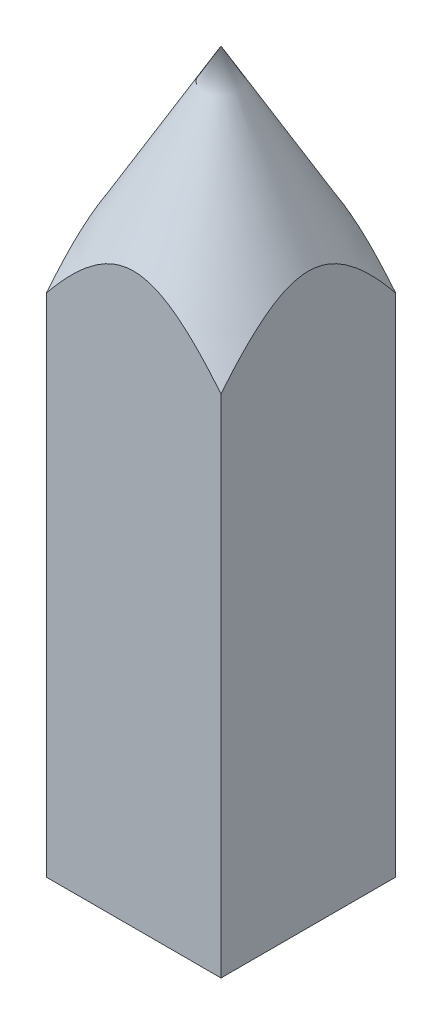
ISO-10303-21;
HEADER;
FILE_DESCRIPTION(('STEP AP214'),'2;1');
FILE_NAME('part.step','',(''),(''),'','','');
FILE_SCHEMA(('AUTOMOTIVE_DESIGN { 1 0 10303 214 1 1 1 1 }'));
ENDSEC;
DATA;
#1=APPLICATION_CONTEXT('core data for automotive mechanical design processes');
#2=APPLICATION_PROTOCOL_DEFINITION('international standard','automotive_design',2000,#1);
#3=PRODUCT_CONTEXT('',#1,'mechanical');
#4=PRODUCT('Part','Part','',(#3));
#5=PRODUCT_RELATED_PRODUCT_CATEGORY('part','',(#4));
#6=PRODUCT_DEFINITION_FORMATION('','',#4);
#7=PRODUCT_DEFINITION_CONTEXT('part definition',#1,'design');
#8=PRODUCT_DEFINITION('design','',#6,#7);
#9=PRODUCT_DEFINITION_SHAPE('','',#8);
#10=(LENGTH_UNIT() NAMED_UNIT(*) SI_UNIT(.MILLI.,.METRE.));
#11=(NAMED_UNIT(*) PLANE_ANGLE_UNIT() SI_UNIT($,.RADIAN.));
#12=(NAMED_UNIT(*) SI_UNIT($,.STERADIAN.) SOLID_ANGLE_UNIT());
#13=UNCERTAINTY_MEASURE_WITH_UNIT(LENGTH_MEASURE(1.E-05),#10,'distance_accuracy_value','');
#14=(GEOMETRIC_REPRESENTATION_CONTEXT(3) GLOBAL_UNCERTAINTY_ASSIGNED_CONTEXT((#13)) GLOBAL_UNIT_ASSIGNED_CONTEXT((#10,
#11,#12)) REPRESENTATION_CONTEXT('',''));
#15=CARTESIAN_POINT('',(0.,0.,0.));
#16=DIRECTION('',(0.,0.,1.));
#17=DIRECTION('',(1.,0.,0.));
#18=AXIS2_PLACEMENT_3D('',#15,#16,#17);
#19=CARTESIAN_POINT('',(0.,28.9578141860761,0.));
#20=DIRECTION('',(0.,-1.,0.));
#21=DIRECTION('',(0.,0.,-1.));
#22=AXIS2_PLACEMENT_3D('',#19,#20,#21);
#23=CONICAL_SURFACE('',#22,7.07106781187,0.523598775598293);
#24=CARTESIAN_POINT('',(-5.0000000000032,23.7736541344682,-8.73424265280935));
#25=CARTESIAN_POINT('',(-5.0000000000032,24.0540652325333,-8.54766544211133));
#26=CARTESIAN_POINT('',(-5.0000000000032,24.3338278924239,-8.36010390508928));
#27=CARTESIAN_POINT('',(-5.0000000000032,24.8917250174469,-7.98250325130816));
#28=CARTESIAN_POINT('',(-5.0000000000032,25.1698592791151,-7.79246383412938));
#29=CARTESIAN_POINT('',(-5.0000000000032,25.7255058395061,-7.40847202366486));
#30=CARTESIAN_POINT('',(-5.0000000000032,26.0030078184527,-7.21450466672878));
#31=CARTESIAN_POINT('',(-5.0000000000032,26.5554072903616,-6.82292758607558));
#32=CARTESIAN_POINT('',(-5.0000000000032,26.8303049497034,-6.6253180974477));
#33=CARTESIAN_POINT('',(-5.0000000000032,27.393866426577,-6.2130458318071));
#34=CARTESIAN_POINT('',(-5.0000000000032,27.6823162265441,-5.99808935307074));
#35=CARTESIAN_POINT('',(-5.0000000000032,28.2541432919948,-5.56155576253747));
#36=CARTESIAN_POINT('',(-5.0000000000032,28.5375209280372,-5.33997913757409));
#37=CARTESIAN_POINT('',(-5.0000000000032,29.096666934399,-4.8885254808277));
#38=CARTESIAN_POINT('',(-5.0000000000032,29.3724502104133,-4.65866711052706));
#39=CARTESIAN_POINT('',(-5.0000000000032,29.7782963827993,-4.30498586101745));
#40=CARTESIAN_POINT('',(-5.0000000000032,29.9122520422274,-4.18563039902351));
#41=CARTESIAN_POINT('',(-5.0000000000032,30.1769225249654,-3.94338595905392));
#42=CARTESIAN_POINT('',(-5.0000000000032,30.3076376793685,-3.82049734486626));
#43=CARTESIAN_POINT('',(-5.0000000000032,30.5059216775693,-3.62788939671447));
#44=CARTESIAN_POINT('',(-5.0000000000032,30.5749350084248,-3.55965615240548));
#45=CARTESIAN_POINT('',(-5.0000000000032,30.7115895042223,-3.42182961094149));
#46=CARTESIAN_POINT('',(-5.0000000000032,30.779230660085,-3.35223630479346));
#47=CARTESIAN_POINT('',(-5.0000000000032,30.9798645420278,-3.14114734004477));
#48=CARTESIAN_POINT('',(-5.0000000000032,31.1105127509677,-2.99739549056884));
#49=CARTESIAN_POINT('',(-5.0000000000032,31.3625228606067,-2.70358444641824));
#50=CARTESIAN_POINT('',(-5.0000000000032,31.4839412938822,-2.55357415983834));
#51=CARTESIAN_POINT('',(-5.0000000000032,31.7151989300796,-2.24494421601222));
#52=CARTESIAN_POINT('',(-5.0000000000032,31.8250476156706,-2.08633177328417));
#53=CARTESIAN_POINT('',(-5.0000000000032,32.0319696440477,-1.7534931046854));
#54=CARTESIAN_POINT('',(-5.0000000000032,32.1285022799582,-1.57892448270719));
#55=CARTESIAN_POINT('',(-5.0000000000032,32.296771371754,-1.21805588659845));
#56=CARTESIAN_POINT('',(-5.0000000000032,32.3685524384725,-1.03177774138263));
#57=CARTESIAN_POINT('',(-5.0000000000032,32.4467879010389,-0.759443677962475));
#58=CARTESIAN_POINT('',(-5.0000000000032,32.4670812654125,-0.67729020924667));
#59=CARTESIAN_POINT('',(-5.0000000000032,32.5009515568315,-0.511625448329228));
#60=CARTESIAN_POINT('',(-5.0000000000032,32.5145315969921,-0.428114804071417));
#61=CARTESIAN_POINT('',(-5.0000000000032,32.5344995815338,-0.260239655929377));
#62=CARTESIAN_POINT('',(-5.0000000000032,32.5408881545041,-0.17587522732292));
#63=CARTESIAN_POINT('',(-5.0000000000032,32.5462364497911,-0.00690787450946477));
#64=CARTESIAN_POINT('',(-5.0000000000032,32.5451960849406,0.0776950524843081));
#65=CARTESIAN_POINT('',(-5.0000000000032,32.5357256906657,0.246432319192591));
#66=CARTESIAN_POINT('',(-5.0000000000032,32.527300265129,0.330566917986507));
#67=CARTESIAN_POINT('',(-5.0000000000032,32.5033876288211,0.497838313341772));
#68=CARTESIAN_POINT('',(-5.0000000000032,32.4878974962884,0.58097468244919));
#69=CARTESIAN_POINT('',(-5.0000000000032,32.4315856748397,0.828080127763474));
#70=CARTESIAN_POINT('',(-5.0000000000032,32.3809146799774,0.9898650598785));
#71=CARTESIAN_POINT('',(-5.0000000000032,32.270488020645,1.27500229542668));
#72=CARTESIAN_POINT('',(-5.0000000000032,32.2143015070797,1.3998050783153));
#73=CARTESIAN_POINT('',(-5.0000000000032,32.091118430921,1.64403341019271));
#74=CARTESIAN_POINT('',(-5.0000000000032,32.0241141158637,1.76345502372688));
#75=CARTESIAN_POINT('',(-5.0000000000032,31.8813439780076,1.99764109197237));
#76=CARTESIAN_POINT('',(-5.0000000000032,31.8055385058628,2.11238105527226));
#77=CARTESIAN_POINT('',(-5.0000000000032,31.647309775319,2.33709595239964));
#78=CARTESIAN_POINT('',(-5.0000000000032,31.5648892110443,2.44707279828406));
#79=CARTESIAN_POINT('',(-5.0000000000032,31.3905455173909,2.66828443026842));
#80=CARTESIAN_POINT('',(-5.0000000000032,31.2983531207694,2.77930568270386));
#81=CARTESIAN_POINT('',(-5.0000000000032,31.109395120986,2.99740358957158));
#82=CARTESIAN_POINT('',(-5.0000000000032,31.0126285519854,3.10447940235218));
#83=CARTESIAN_POINT('',(-5.0000000000032,30.8153603451829,3.31530318432316));
#84=CARTESIAN_POINT('',(-5.0000000000032,30.7148553744544,3.41904802250085));
#85=CARTESIAN_POINT('',(-5.0000000000032,30.5108707476953,3.62357784634008));
#86=CARTESIAN_POINT('',(-5.0000000000032,30.4073908164446,3.72436255639884));
#87=CARTESIAN_POINT('',(-5.0000000000032,30.0925703966218,4.02358697141119));
#88=CARTESIAN_POINT('',(-5.0000000000032,29.8775534272445,4.2181589865785));
#89=CARTESIAN_POINT('',(-5.0000000000032,29.4408474959083,4.59936582831352));
#90=CARTESIAN_POINT('',(-5.0000000000032,29.2191617253118,4.786004351435));
#91=CARTESIAN_POINT('',(-5.0000000000032,28.7673899292071,5.15600289491754));
#92=CARTESIAN_POINT('',(-5.0000000000032,28.5372272690637,5.33926903528306));
#93=CARTESIAN_POINT('',(-5.0000000000032,28.073033106822,5.70086526331649));
#94=CARTESIAN_POINT('',(-5.0000000000032,27.8390011951877,5.8791948230663));
#95=CARTESIAN_POINT('',(-5.0000000000032,27.3685231679728,6.23145183617741));
#96=CARTESIAN_POINT('',(-5.0000000000032,27.1320841226582,6.40538875522379));
#97=CARTESIAN_POINT('',(-5.0000000000032,26.6568749521142,6.75001674844249));
#98=CARTESIAN_POINT('',(-5.0000000000032,26.4181049430233,6.92070798309216));
#99=CARTESIAN_POINT('',(-5.0000000000032,25.9119593971503,7.27828871242433));
#100=CARTESIAN_POINT('',(-5.0000000000032,25.6443616294906,7.46486326913252));
#101=CARTESIAN_POINT('',(-5.0000000000032,25.1072890686513,7.83529329559788));
#102=CARTESIAN_POINT('',(-5.0000000000032,24.8378142516572,8.01914873076414));
#103=CARTESIAN_POINT('',(-5.0000000000032,24.0270826230258,8.56736118954026));
#104=CARTESIAN_POINT('',(-5.0000000000032,23.4835455785291,8.92834548576798));
#105=CARTESIAN_POINT('',(-5.0000000000032,22.3921682508917,9.64396800791292));
#106=CARTESIAN_POINT('',(-5.0000000000032,21.8443271066892,9.99860491494592));
#107=CARTESIAN_POINT('',(-5.0000000000032,20.7455770467977,10.7031012010906));
#108=CARTESIAN_POINT('',(-5.0000000000032,20.1946680986819,11.0529605295676));
#109=CARTESIAN_POINT('',(-5.0000000000032,19.0895730568646,11.7496447825337));
#110=CARTESIAN_POINT('',(-5.0000000000032,18.5353828849934,12.0964632285595));
#111=CARTESIAN_POINT('',(-5.0000000000032,17.4252174345547,12.7872367719154));
#112=CARTESIAN_POINT('',(-5.0000000000032,16.8692421445285,13.1311918508144));
#113=CARTESIAN_POINT('',(-5.0000000000032,15.7559572032741,13.8167748625702));
#114=CARTESIAN_POINT('',(-5.0000000000032,15.198647731004,14.1584030862264));
#115=CARTESIAN_POINT('',(-5.0000000000032,14.0828975479053,14.8398070379077));
#116=CARTESIAN_POINT('',(-5.0000000000032,13.5244568362963,15.1795827646542));
#117=CARTESIAN_POINT('',(-5.0000000000032,11.9656521302576,16.1251264253137));
#118=CARTESIAN_POINT('',(-5.0000000000032,10.96427786038,16.7292286185559));
#119=CARTESIAN_POINT('',(-5.0000000000032,8.95938674977834,17.9339498346395));
#120=CARTESIAN_POINT('',(-5.0000000000032,7.95586982873238,18.5345687236502));
#121=CARTESIAN_POINT('',(-5.0000000000032,5.94974069610893,19.7317063138774));
#122=CARTESIAN_POINT('',(-5.0000000000032,4.94713233274883,20.3282314671117));
#123=CARTESIAN_POINT('',(-5.0000000000032,2.94074522768082,21.5192101152898));
#124=CARTESIAN_POINT('',(-5.0000000000032,1.93696653932907,22.1136637001009));
#125=CARTESIAN_POINT('',(-5.0000000000032,0.932752627348328,22.7073782697805));
#126=B_SPLINE_CURVE_WITH_KNOTS('',3,(#24,#25,#26,#27,#28,#29,#30,#31,#32,#33,#34,#35,#36,#37,
#38,#39,#40,#41,#42,#43,#44,#45,#46,#47,#48,#49,#50,#51,#52,#53,#54,#55,#56,#57,#58,#59,#60,#61,
#62,#63,#64,#65,#66,#67,#68,#69,#70,#71,#72,#73,#74,#75,#76,#77,#78,#79,#80,#81,#82,#83,#84,#85,
#86,#87,#88,#89,#90,#91,#92,#93,#94,#95,#96,#97,#98,#99,#100,#101,#102,#103,#104,#105,#106,#107,
#108,#109,#110,#111,#112,#113,#114,#115,#116,#117,#118,#119,#120,#121,#122,#123,#124,#125),
.UNSPECIFIED.,.F.,.F.,(4,2,2,2,2,2,2,2,2,2,2,2,2,2,2,2,2,2,2,2,2,2,2,2,2,2,2,2,2,2,2,2,2,2,2,2,
2,2,2,2,2,2,2,2,2,2,2,2,2,2,4),(0.,1.01043803253413,2.02099973186052,3.03668997097113,
4.052314878182,5.13144510306951,6.21049616505982,7.28725160962294,7.82545051008001,
8.36359419241303,8.65472547500499,8.94585868327326,9.52835361518778,10.1069319804137,
10.6850323857187,11.2821955337718,11.8782766929208,12.1319146181267,12.3854348152905,
12.6389328511338,12.8924338613992,13.1457769500412,13.3992249093062,13.9057658078872,
14.3158167625183,14.7261628909995,15.1384351427028,15.5505403323544,15.9833136567052,
16.4161787731449,16.8494395176064,17.282740473759,18.1523986743461,19.021647119891,
19.9041978407703,20.7868425798832,21.6673869221442,22.5478876135813,23.526522554569,
24.5051699344248,26.4625633841046,28.420358934164,30.3781752176323,32.3394621012104,
34.3007615995534,36.2618113126743,38.2228623790785,41.7312993496416,45.2398702352303,
48.7398092363002,52.2395944667742),.UNSPECIFIED.);
#127=CARTESIAN_POINT('',(-5.0000000000032,28.9578141860761,5.0000000000032));
#128=VERTEX_POINT('',#127);
#129=CARTESIAN_POINT('',(-5.0000000000032,28.9578141860761,-5.0000000000032));
#130=VERTEX_POINT('',#129);
#131=EDGE_CURVE('E12',#128,#130,#126,.F.);
#132=ORIENTED_EDGE('',*,*,#131,.F.);
#133=CARTESIAN_POINT('',(-8.73424265280935,23.7736541344682,5.0000000000032));
#134=CARTESIAN_POINT('',(-8.54766544211133,24.0540652325333,5.0000000000032));
#135=CARTESIAN_POINT('',(-8.36010390508928,24.3338278924239,5.0000000000032));
#136=CARTESIAN_POINT('',(-7.98250325130817,24.8917250174469,5.0000000000032));
#137=CARTESIAN_POINT('',(-7.79246383412939,25.1698592791151,5.0000000000032));
#138=CARTESIAN_POINT('',(-7.40847202366486,25.7255058395061,5.0000000000032));
#139=CARTESIAN_POINT('',(-7.21450466672879,26.0030078184527,5.0000000000032));
#140=CARTESIAN_POINT('',(-6.82292758607559,26.5554072903616,5.0000000000032));
#141=CARTESIAN_POINT('',(-6.62531809744771,26.8303049497034,5.0000000000032));
#142=CARTESIAN_POINT('',(-6.2130458318071,27.3938664265769,5.0000000000032));
#143=CARTESIAN_POINT('',(-5.99808935307075,27.6823162265441,5.0000000000032));
#144=CARTESIAN_POINT('',(-5.56155576253747,28.2541432919947,5.0000000000032));
#145=CARTESIAN_POINT('',(-5.33997913757409,28.5375209280372,5.0000000000032));
#146=CARTESIAN_POINT('',(-4.8885254808277,29.096666934399,5.0000000000032));
#147=CARTESIAN_POINT('',(-4.65866711052706,29.3724502104133,5.0000000000032));
#148=CARTESIAN_POINT('',(-4.30498586101745,29.7782963827993,5.0000000000032));
#149=CARTESIAN_POINT('',(-4.18563039902352,29.9122520422274,5.0000000000032));
#150=CARTESIAN_POINT('',(-3.94338595905392,30.1769225249654,5.0000000000032));
#151=CARTESIAN_POINT('',(-3.82049734486626,30.3076376793685,5.0000000000032));
#152=CARTESIAN_POINT('',(-3.62788939671446,30.5059216775693,5.0000000000032));
#153=CARTESIAN_POINT('',(-3.55965615240548,30.5749350084248,5.0000000000032));
#154=CARTESIAN_POINT('',(-3.42182961094149,30.7115895042223,5.0000000000032));
#155=CARTESIAN_POINT('',(-3.35223630479346,30.779230660085,5.0000000000032));
#156=CARTESIAN_POINT('',(-3.14114734004476,30.9798645420278,5.0000000000032));
#157=CARTESIAN_POINT('',(-2.99739549056884,31.1105127509677,5.0000000000032));
#158=CARTESIAN_POINT('',(-2.70358444641824,31.3625228606067,5.0000000000032));
#159=CARTESIAN_POINT('',(-2.55357415983834,31.4839412938822,5.0000000000032));
#160=CARTESIAN_POINT('',(-2.24494421601222,31.7151989300795,5.0000000000032));
#161=CARTESIAN_POINT('',(-2.08633177328418,31.8250476156706,5.0000000000032));
#162=CARTESIAN_POINT('',(-1.75349310468541,32.0319696440477,5.0000000000032));
#163=CARTESIAN_POINT('',(-1.5789244827072,32.1285022799582,5.0000000000032));
#164=CARTESIAN_POINT('',(-1.21805588659846,32.296771371754,5.0000000000032));
#165=CARTESIAN_POINT('',(-1.03177774138264,32.3685524384725,5.0000000000032));
#166=CARTESIAN_POINT('',(-0.759443677962486,32.4467879010389,5.0000000000032));
#167=CARTESIAN_POINT('',(-0.67729020924668,32.4670812654125,5.0000000000032));
#168=CARTESIAN_POINT('',(-0.511625448329238,32.5009515568315,5.0000000000032));
#169=CARTESIAN_POINT('',(-0.428114804071427,32.5145315969921,5.0000000000032));
#170=CARTESIAN_POINT('',(-0.260239655929387,32.5344995815338,5.0000000000032));
#171=CARTESIAN_POINT('',(-0.175875227322929,32.5408881545041,5.0000000000032));
#172=CARTESIAN_POINT('',(-0.00690787450947375,32.5462364497911,5.0000000000032));
#173=CARTESIAN_POINT('',(0.0776950524842993,32.5451960849406,5.0000000000032));
#174=CARTESIAN_POINT('',(0.246432319192582,32.5357256906657,5.0000000000032));
#175=CARTESIAN_POINT('',(0.330566917986498,32.527300265129,5.0000000000032));
#176=CARTESIAN_POINT('',(0.497838313341764,32.5033876288211,5.0000000000032));
#177=CARTESIAN_POINT('',(0.580974682449183,32.4878974962884,5.0000000000032));
#178=CARTESIAN_POINT('',(0.828080127763468,32.4315856748397,5.0000000000032));
#179=CARTESIAN_POINT('',(0.989865059878495,32.3809146799774,5.0000000000032));
#180=CARTESIAN_POINT('',(1.27500229542668,32.270488020645,5.0000000000032));
#181=CARTESIAN_POINT('',(1.3998050783153,32.2143015070797,5.0000000000032));
#182=CARTESIAN_POINT('',(1.64403341019271,32.091118430921,5.0000000000032));
#183=CARTESIAN_POINT('',(1.76345502372688,32.0241141158636,5.0000000000032));
#184=CARTESIAN_POINT('',(1.99764109197237,31.8813439780076,5.0000000000032));
#185=CARTESIAN_POINT('',(2.11238105527225,31.8055385058629,5.0000000000032));
#186=CARTESIAN_POINT('',(2.33709595239964,31.647309775319,5.0000000000032));
#187=CARTESIAN_POINT('',(2.44707279828405,31.5648892110443,5.0000000000032));
#188=CARTESIAN_POINT('',(2.66828443026841,31.3905455173909,5.0000000000032));
#189=CARTESIAN_POINT('',(2.77930568270385,31.2983531207694,5.0000000000032));
#190=CARTESIAN_POINT('',(2.99740358957157,31.109395120986,5.0000000000032));
#191=CARTESIAN_POINT('',(3.10447940235217,31.0126285519854,5.0000000000032));
#192=CARTESIAN_POINT('',(3.31530318432314,30.8153603451829,5.0000000000032));
#193=CARTESIAN_POINT('',(3.41904802250083,30.7148553744544,5.0000000000032));
#194=CARTESIAN_POINT('',(3.62357784634006,30.5108707476953,5.0000000000032));
#195=CARTESIAN_POINT('',(3.72436255639882,30.4073908164447,5.0000000000032));
#196=CARTESIAN_POINT('',(4.02358697141116,30.0925703966219,5.0000000000032));
#197=CARTESIAN_POINT('',(4.21815898657848,29.8775534272445,5.0000000000032));
#198=CARTESIAN_POINT('',(4.59936582831349,29.4408474959083,5.0000000000032));
#199=CARTESIAN_POINT('',(4.78600435143498,29.2191617253118,5.0000000000032));
#200=CARTESIAN_POINT('',(5.15600289491751,28.7673899292072,5.0000000000032));
#201=CARTESIAN_POINT('',(5.33926903528302,28.5372272690637,5.0000000000032));
#202=CARTESIAN_POINT('',(5.70086526331646,28.0730331068221,5.0000000000032));
#203=CARTESIAN_POINT('',(5.87919482306626,27.8390011951878,5.0000000000032));
#204=CARTESIAN_POINT('',(6.23145183617738,27.3685231679728,5.0000000000032));
#205=CARTESIAN_POINT('',(6.40538875522376,27.1320841226583,5.0000000000032));
#206=CARTESIAN_POINT('',(6.75001674844246,26.6568749521142,5.0000000000032));
#207=CARTESIAN_POINT('',(6.92070798309212,26.4181049430234,5.0000000000032));
#208=CARTESIAN_POINT('',(7.27828871242429,25.9119593971504,5.0000000000032));
#209=CARTESIAN_POINT('',(7.46486326913248,25.6443616294906,5.0000000000032));
#210=CARTESIAN_POINT('',(7.83529329559784,25.1072890686513,5.0000000000032));
#211=CARTESIAN_POINT('',(8.01914873076411,24.8378142516572,5.0000000000032));
#212=CARTESIAN_POINT('',(8.56736118954022,24.0270826230258,5.0000000000032));
#213=CARTESIAN_POINT('',(8.92834548576795,23.4835455785292,5.0000000000032));
#214=CARTESIAN_POINT('',(9.64396800791289,22.3921682508917,5.0000000000032));
#215=CARTESIAN_POINT('',(9.99860491494589,21.8443271066892,5.0000000000032));
#216=CARTESIAN_POINT('',(10.7031012010906,20.7455770467977,5.0000000000032));
#217=CARTESIAN_POINT('',(11.0529605295676,20.194668098682,5.0000000000032));
#218=CARTESIAN_POINT('',(11.7496447825337,19.0895730568646,5.0000000000032));
#219=CARTESIAN_POINT('',(12.0964632285595,18.5353828849935,5.0000000000032));
#220=CARTESIAN_POINT('',(12.7872367719153,17.4252174345548,5.0000000000032));
#221=CARTESIAN_POINT('',(13.1311918508143,16.8692421445286,5.0000000000032));
#222=CARTESIAN_POINT('',(13.8167748625701,15.7559572032742,5.0000000000032));
#223=CARTESIAN_POINT('',(14.1584030862264,15.198647731004,5.0000000000032));
#224=CARTESIAN_POINT('',(14.8398070379077,14.0828975479053,5.0000000000032));
#225=CARTESIAN_POINT('',(15.1795827646541,13.5244568362964,5.0000000000032));
#226=CARTESIAN_POINT('',(16.1251264253137,11.9656521302576,5.0000000000032));
#227=CARTESIAN_POINT('',(16.7292286185559,10.9642778603801,5.0000000000032));
#228=CARTESIAN_POINT('',(17.9339498346395,8.95938674977838,5.0000000000032));
#229=CARTESIAN_POINT('',(18.5345687236502,7.95586982873243,5.0000000000032));
#230=CARTESIAN_POINT('',(19.7317063138773,5.94974069610898,5.0000000000032));
#231=CARTESIAN_POINT('',(20.3282314671116,4.94713233274889,5.0000000000032));
#232=CARTESIAN_POINT('',(21.5192101152898,2.94074522768088,5.0000000000032));
#233=CARTESIAN_POINT('',(22.1136637001009,1.93696653932914,5.0000000000032));
#234=CARTESIAN_POINT('',(22.7073782697804,0.932752627348392,5.0000000000032));
#235=B_SPLINE_CURVE_WITH_KNOTS('',3,(#133,#134,#135,#136,#137,#138,#139,#140,#141,#142,#143,
#144,#145,#146,#147,#148,#149,#150,#151,#152,#153,#154,#155,#156,#157,#158,#159,#160,#161,#162,
#163,#164,#165,#166,#167,#168,#169,#170,#171,#172,#173,#174,#175,#176,#177,#178,#179,#180,#181,
#182,#183,#184,#185,#186,#187,#188,#189,#190,#191,#192,#193,#194,#195,#196,#197,#198,#199,#200,
#201,#202,#203,#204,#205,#206,#207,#208,#209,#210,#211,#212,#213,#214,#215,#216,#217,#218,#219,
#220,#221,#222,#223,#224,#225,#226,#227,#228,#229,#230,#231,#232,#233,#234),.UNSPECIFIED.,.F.,
.F.,(4,2,2,2,2,2,2,2,2,2,2,2,2,2,2,2,2,2,2,2,2,2,2,2,2,2,2,2,2,2,2,2,2,2,2,2,2,2,2,2,2,2,2,2,2,
2,2,2,2,2,4),(0.,1.01043803253413,2.02099973186051,3.03668997097112,4.05231487818199,
5.1314451030695,6.21049616505981,7.28725160962294,7.82545051008,8.36359419241303,
8.65472547500499,8.94585868327326,9.52835361518778,10.1069319804136,10.6850323857187,
11.2821955337718,11.8782766929207,12.1319146181267,12.3854348152905,12.6389328511338,
12.8924338613992,13.1457769500412,13.3992249093062,13.9057658078872,14.3158167625183,
14.7261628909995,15.1384351427028,15.5505403323544,15.9833136567052,16.4161787731449,
16.8494395176064,17.282740473759,18.1523986743461,19.021647119891,19.9041978407702,
20.7868425798832,21.6673869221442,22.5478876135812,23.5265225545689,24.5051699344247,
26.4625633841046,28.420358934164,30.3781752176322,32.3394621012104,34.3007615995533,
36.2618113126742,38.2228623790785,41.7312993496416,45.2398702352302,48.7398092363001,
52.2395944667742),.UNSPECIFIED.);
#236=CARTESIAN_POINT('',(5.0000000000032,28.9578141860761,5.0000000000032));
#237=VERTEX_POINT('',#236);
#238=EDGE_CURVE('E48',#237,#128,#235,.F.);
#239=ORIENTED_EDGE('',*,*,#238,.F.);
#240=CARTESIAN_POINT('',(5.0000000000032,23.7736541344682,-8.73424265280935));
#241=CARTESIAN_POINT('',(5.0000000000032,24.0540652325333,-8.54766544211133));
#242=CARTESIAN_POINT('',(5.0000000000032,24.3338278924239,-8.36010390508928));
#243=CARTESIAN_POINT('',(5.0000000000032,24.8917250174469,-7.98250325130816));
#244=CARTESIAN_POINT('',(5.0000000000032,25.1698592791151,-7.79246383412938));
#245=CARTESIAN_POINT('',(5.0000000000032,25.7255058395061,-7.40847202366486));
#246=CARTESIAN_POINT('',(5.0000000000032,26.0030078184527,-7.21450466672878));
#247=CARTESIAN_POINT('',(5.0000000000032,26.5554072903616,-6.82292758607558));
#248=CARTESIAN_POINT('',(5.0000000000032,26.8303049497034,-6.6253180974477));
#249=CARTESIAN_POINT('',(5.0000000000032,27.393866426577,-6.2130458318071));
#250=CARTESIAN_POINT('',(5.0000000000032,27.6823162265441,-5.99808935307074));
#251=CARTESIAN_POINT('',(5.0000000000032,28.2541432919948,-5.56155576253747));
#252=CARTESIAN_POINT('',(5.0000000000032,28.5375209280372,-5.33997913757409));
#253=CARTESIAN_POINT('',(5.0000000000032,29.096666934399,-4.8885254808277));
#254=CARTESIAN_POINT('',(5.0000000000032,29.3724502104133,-4.65866711052706));
#255=CARTESIAN_POINT('',(5.0000000000032,29.7782963827993,-4.30498586101745));
#256=CARTESIAN_POINT('',(5.0000000000032,29.9122520422274,-4.18563039902351));
#257=CARTESIAN_POINT('',(5.0000000000032,30.1769225249654,-3.94338595905392));
#258=CARTESIAN_POINT('',(5.0000000000032,30.3076376793685,-3.82049734486626));
#259=CARTESIAN_POINT('',(5.0000000000032,30.5059216775693,-3.62788939671447));
#260=CARTESIAN_POINT('',(5.0000000000032,30.5749350084248,-3.55965615240548));
#261=CARTESIAN_POINT('',(5.0000000000032,30.7115895042223,-3.42182961094149));
#262=CARTESIAN_POINT('',(5.0000000000032,30.779230660085,-3.35223630479346));
#263=CARTESIAN_POINT('',(5.0000000000032,30.9798645420278,-3.14114734004477));
#264=CARTESIAN_POINT('',(5.0000000000032,31.1105127509677,-2.99739549056884));
#265=CARTESIAN_POINT('',(5.0000000000032,31.3625228606067,-2.70358444641824));
#266=CARTESIAN_POINT('',(5.0000000000032,31.4839412938822,-2.55357415983834));
#267=CARTESIAN_POINT('',(5.0000000000032,31.7151989300796,-2.24494421601222));
#268=CARTESIAN_POINT('',(5.0000000000032,31.8250476156706,-2.08633177328417));
#269=CARTESIAN_POINT('',(5.0000000000032,32.0319696440477,-1.7534931046854));
#270=CARTESIAN_POINT('',(5.0000000000032,32.1285022799582,-1.57892448270719));
#271=CARTESIAN_POINT('',(5.0000000000032,32.296771371754,-1.21805588659845));
#272=CARTESIAN_POINT('',(5.0000000000032,32.3685524384725,-1.03177774138263));
#273=CARTESIAN_POINT('',(5.0000000000032,32.4467879010389,-0.759443677962475));
#274=CARTESIAN_POINT('',(5.0000000000032,32.4670812654125,-0.67729020924667));
#275=CARTESIAN_POINT('',(5.0000000000032,32.5009515568315,-0.511625448329228));
#276=CARTESIAN_POINT('',(5.0000000000032,32.5145315969921,-0.428114804071417));
#277=CARTESIAN_POINT('',(5.0000000000032,32.5344995815338,-0.260239655929377));
#278=CARTESIAN_POINT('',(5.0000000000032,32.5408881545041,-0.17587522732292));
#279=CARTESIAN_POINT('',(5.0000000000032,32.5462364497911,-0.00690787450946477));
#280=CARTESIAN_POINT('',(5.0000000000032,32.5451960849406,0.0776950524843081));
#281=CARTESIAN_POINT('',(5.0000000000032,32.5357256906657,0.246432319192591));
#282=CARTESIAN_POINT('',(5.0000000000032,32.527300265129,0.330566917986507));
#283=CARTESIAN_POINT('',(5.0000000000032,32.5033876288211,0.497838313341772));
#284=CARTESIAN_POINT('',(5.0000000000032,32.4878974962884,0.58097468244919));
#285=CARTESIAN_POINT('',(5.0000000000032,32.4315856748397,0.828080127763474));
#286=CARTESIAN_POINT('',(5.0000000000032,32.3809146799774,0.9898650598785));
#287=CARTESIAN_POINT('',(5.0000000000032,32.270488020645,1.27500229542668));
#288=CARTESIAN_POINT('',(5.0000000000032,32.2143015070797,1.3998050783153));
#289=CARTESIAN_POINT('',(5.0000000000032,32.091118430921,1.64403341019271));
#290=CARTESIAN_POINT('',(5.0000000000032,32.0241141158637,1.76345502372688));
#291=CARTESIAN_POINT('',(5.0000000000032,31.8813439780076,1.99764109197237));
#292=CARTESIAN_POINT('',(5.0000000000032,31.8055385058628,2.11238105527226));
#293=CARTESIAN_POINT('',(5.0000000000032,31.647309775319,2.33709595239964));
#294=CARTESIAN_POINT('',(5.0000000000032,31.5648892110443,2.44707279828406));
#295=CARTESIAN_POINT('',(5.0000000000032,31.3905455173909,2.66828443026842));
#296=CARTESIAN_POINT('',(5.0000000000032,31.2983531207694,2.77930568270386));
#297=CARTESIAN_POINT('',(5.0000000000032,31.109395120986,2.99740358957158));
#298=CARTESIAN_POINT('',(5.0000000000032,31.0126285519854,3.10447940235218));
#299=CARTESIAN_POINT('',(5.0000000000032,30.8153603451829,3.31530318432316));
#300=CARTESIAN_POINT('',(5.0000000000032,30.7148553744544,3.41904802250085));
#301=CARTESIAN_POINT('',(5.0000000000032,30.5108707476953,3.62357784634008));
#302=CARTESIAN_POINT('',(5.0000000000032,30.4073908164446,3.72436255639884));
#303=CARTESIAN_POINT('',(5.0000000000032,30.0925703966218,4.02358697141119));
#304=CARTESIAN_POINT('',(5.0000000000032,29.8775534272445,4.2181589865785));
#305=CARTESIAN_POINT('',(5.0000000000032,29.4408474959083,4.59936582831352));
#306=CARTESIAN_POINT('',(5.0000000000032,29.2191617253118,4.786004351435));
#307=CARTESIAN_POINT('',(5.0000000000032,28.7673899292071,5.15600289491754));
#308=CARTESIAN_POINT('',(5.0000000000032,28.5372272690637,5.33926903528306));
#309=CARTESIAN_POINT('',(5.0000000000032,28.073033106822,5.70086526331649));
#310=CARTESIAN_POINT('',(5.0000000000032,27.8390011951877,5.8791948230663));
#311=CARTESIAN_POINT('',(5.0000000000032,27.3685231679728,6.23145183617741));
#312=CARTESIAN_POINT('',(5.0000000000032,27.1320841226582,6.40538875522379));
#313=CARTESIAN_POINT('',(5.0000000000032,26.6568749521142,6.75001674844249));
#314=CARTESIAN_POINT('',(5.0000000000032,26.4181049430233,6.92070798309216));
#315=CARTESIAN_POINT('',(5.0000000000032,25.9119593971503,7.27828871242433));
#316=CARTESIAN_POINT('',(5.0000000000032,25.6443616294906,7.46486326913252));
#317=CARTESIAN_POINT('',(5.0000000000032,25.1072890686513,7.83529329559788));
#318=CARTESIAN_POINT('',(5.0000000000032,24.8378142516572,8.01914873076414));
#319=CARTESIAN_POINT('',(5.0000000000032,24.0270826230258,8.56736118954026));
#320=CARTESIAN_POINT('',(5.0000000000032,23.4835455785291,8.92834548576798));
#321=CARTESIAN_POINT('',(5.0000000000032,22.3921682508917,9.64396800791292));
#322=CARTESIAN_POINT('',(5.0000000000032,21.8443271066892,9.99860491494592));
#323=CARTESIAN_POINT('',(5.0000000000032,20.7455770467977,10.7031012010906));
#324=CARTESIAN_POINT('',(5.0000000000032,20.1946680986819,11.0529605295676));
#325=CARTESIAN_POINT('',(5.0000000000032,19.0895730568646,11.7496447825337));
#326=CARTESIAN_POINT('',(5.0000000000032,18.5353828849934,12.0964632285595));
#327=CARTESIAN_POINT('',(5.0000000000032,17.4252174345547,12.7872367719154));
#328=CARTESIAN_POINT('',(5.0000000000032,16.8692421445285,13.1311918508144));
#329=CARTESIAN_POINT('',(5.0000000000032,15.7559572032741,13.8167748625702));
#330=CARTESIAN_POINT('',(5.0000000000032,15.198647731004,14.1584030862264));
#331=CARTESIAN_POINT('',(5.0000000000032,14.0828975479053,14.8398070379077));
#332=CARTESIAN_POINT('',(5.0000000000032,13.5244568362963,15.1795827646542));
#333=CARTESIAN_POINT('',(5.0000000000032,11.9656521302576,16.1251264253137));
#334=CARTESIAN_POINT('',(5.0000000000032,10.96427786038,16.7292286185559));
#335=CARTESIAN_POINT('',(5.0000000000032,8.95938674977834,17.9339498346395));
#336=CARTESIAN_POINT('',(5.0000000000032,7.95586982873238,18.5345687236502));
#337=CARTESIAN_POINT('',(5.0000000000032,5.94974069610893,19.7317063138774));
#338=CARTESIAN_POINT('',(5.0000000000032,4.94713233274883,20.3282314671117));
#339=CARTESIAN_POINT('',(5.0000000000032,2.94074522768082,21.5192101152898));
#340=CARTESIAN_POINT('',(5.0000000000032,1.93696653932907,22.1136637001009));
#341=CARTESIAN_POINT('',(5.0000000000032,0.932752627348328,22.7073782697805));
#342=B_SPLINE_CURVE_WITH_KNOTS('',3,(#240,#241,#242,#243,#244,#245,#246,#247,#248,#249,#250,
#251,#252,#253,#254,#255,#256,#257,#258,#259,#260,#261,#262,#263,#264,#265,#266,#267,#268,#269,
#270,#271,#272,#273,#274,#275,#276,#277,#278,#279,#280,#281,#282,#283,#284,#285,#286,#287,#288,
#289,#290,#291,#292,#293,#294,#295,#296,#297,#298,#299,#300,#301,#302,#303,#304,#305,#306,#307,
#308,#309,#310,#311,#312,#313,#314,#315,#316,#317,#318,#319,#320,#321,#322,#323,#324,#325,#326,
#327,#328,#329,#330,#331,#332,#333,#334,#335,#336,#337,#338,#339,#340,#341),.UNSPECIFIED.,.F.,
.F.,(4,2,2,2,2,2,2,2,2,2,2,2,2,2,2,2,2,2,2,2,2,2,2,2,2,2,2,2,2,2,2,2,2,2,2,2,2,2,2,2,2,2,2,2,2,
2,2,2,2,2,4),(0.,1.01043803253413,2.02099973186052,3.03668997097113,4.052314878182,
5.13144510306951,6.21049616505982,7.28725160962294,7.82545051008001,8.36359419241303,
8.65472547500499,8.94585868327326,9.52835361518778,10.1069319804137,10.6850323857187,
11.2821955337718,11.8782766929208,12.1319146181267,12.3854348152905,12.6389328511338,
12.8924338613992,13.1457769500412,13.3992249093062,13.9057658078872,14.3158167625183,
14.7261628909995,15.1384351427028,15.5505403323544,15.9833136567052,16.4161787731449,
16.8494395176064,17.282740473759,18.1523986743461,19.021647119891,19.9041978407703,
20.7868425798832,21.6673869221442,22.5478876135813,23.526522554569,24.5051699344248,
26.4625633841046,28.420358934164,30.3781752176323,32.3394621012104,34.3007615995534,
36.2618113126743,38.2228623790785,41.7312993496416,45.2398702352303,48.7398092363002,
52.2395944667742),.UNSPECIFIED.);
#343=CARTESIAN_POINT('',(5.0000000000032,28.9578141860761,-5.0000000000032));
#344=VERTEX_POINT('',#343);
#345=EDGE_CURVE('E116',#344,#237,#342,.T.);
#346=ORIENTED_EDGE('',*,*,#345,.F.);
#347=CARTESIAN_POINT('',(-8.73424265280935,23.7736541344682,-5.0000000000032));
#348=CARTESIAN_POINT('',(-8.54766544211133,24.0540652325333,-5.0000000000032));
#349=CARTESIAN_POINT('',(-8.36010390508928,24.3338278924239,-5.0000000000032));
#350=CARTESIAN_POINT('',(-7.98250325130816,24.8917250174469,-5.0000000000032));
#351=CARTESIAN_POINT('',(-7.79246383412938,25.1698592791151,-5.0000000000032));
#352=CARTESIAN_POINT('',(-7.40847202366486,25.7255058395061,-5.0000000000032));
#353=CARTESIAN_POINT('',(-7.21450466672879,26.0030078184526,-5.0000000000032));
#354=CARTESIAN_POINT('',(-6.82292758607559,26.5554072903616,-5.0000000000032));
#355=CARTESIAN_POINT('',(-6.62531809744771,26.8303049497034,-5.0000000000032));
#356=CARTESIAN_POINT('',(-6.2130458318071,27.3938664265769,-5.0000000000032));
#357=CARTESIAN_POINT('',(-5.99808935307075,27.6823162265441,-5.0000000000032));
#358=CARTESIAN_POINT('',(-5.56155576253747,28.2541432919947,-5.0000000000032));
#359=CARTESIAN_POINT('',(-5.33997913757409,28.5375209280372,-5.0000000000032));
#360=CARTESIAN_POINT('',(-4.8885254808277,29.096666934399,-5.0000000000032));
#361=CARTESIAN_POINT('',(-4.65866711052706,29.3724502104133,-5.0000000000032));
#362=CARTESIAN_POINT('',(-4.30498586101745,29.7782963827993,-5.0000000000032));
#363=CARTESIAN_POINT('',(-4.18563039902351,29.9122520422274,-5.0000000000032));
#364=CARTESIAN_POINT('',(-3.94338595905391,30.1769225249654,-5.0000000000032));
#365=CARTESIAN_POINT('',(-3.82049734486626,30.3076376793685,-5.0000000000032));
#366=CARTESIAN_POINT('',(-3.62788939671446,30.5059216775693,-5.0000000000032));
#367=CARTESIAN_POINT('',(-3.55965615240548,30.5749350084248,-5.0000000000032));
#368=CARTESIAN_POINT('',(-3.4218296109415,30.7115895042223,-5.0000000000032));
#369=CARTESIAN_POINT('',(-3.35223630479346,30.779230660085,-5.0000000000032));
#370=CARTESIAN_POINT('',(-3.14114734004477,30.9798645420278,-5.0000000000032));
#371=CARTESIAN_POINT('',(-2.99739549056884,31.1105127509677,-5.0000000000032));
#372=CARTESIAN_POINT('',(-2.70358444641824,31.3625228606067,-5.0000000000032));
#373=CARTESIAN_POINT('',(-2.55357415983834,31.4839412938822,-5.0000000000032));
#374=CARTESIAN_POINT('',(-2.24494421601222,31.7151989300795,-5.0000000000032));
#375=CARTESIAN_POINT('',(-2.08633177328418,31.8250476156706,-5.0000000000032));
#376=CARTESIAN_POINT('',(-1.75349310468541,32.0319696440477,-5.0000000000032));
#377=CARTESIAN_POINT('',(-1.5789244827072,32.1285022799582,-5.0000000000032));
#378=CARTESIAN_POINT('',(-1.21805588659845,32.296771371754,-5.0000000000032));
#379=CARTESIAN_POINT('',(-1.03177774138264,32.3685524384725,-5.0000000000032));
#380=CARTESIAN_POINT('',(-0.759443677962483,32.4467879010389,-5.0000000000032));
#381=CARTESIAN_POINT('',(-0.677290209246677,32.4670812654125,-5.0000000000032));
#382=CARTESIAN_POINT('',(-0.511625448329234,32.5009515568315,-5.0000000000032));
#383=CARTESIAN_POINT('',(-0.428114804071422,32.514531596992,-5.0000000000032));
#384=CARTESIAN_POINT('',(-0.260239655929381,32.5344995815338,-5.0000000000032));
#385=CARTESIAN_POINT('',(-0.175875227322923,32.5408881545041,-5.0000000000032));
#386=CARTESIAN_POINT('',(-0.00690787450946714,32.5462364497911,-5.0000000000032));
#387=CARTESIAN_POINT('',(0.0776950524843058,32.5451960849406,-5.0000000000032));
#388=CARTESIAN_POINT('',(0.246432319192588,32.5357256906657,-5.0000000000032));
#389=CARTESIAN_POINT('',(0.330566917986505,32.527300265129,-5.0000000000032));
#390=CARTESIAN_POINT('',(0.497838313341771,32.5033876288211,-5.0000000000032));
#391=CARTESIAN_POINT('',(0.580974682449189,32.4878974962884,-5.0000000000032));
#392=CARTESIAN_POINT('',(0.828080127763475,32.4315856748397,-5.0000000000032));
#393=CARTESIAN_POINT('',(0.989865059878501,32.3809146799774,-5.0000000000032));
#394=CARTESIAN_POINT('',(1.27500229542669,32.270488020645,-5.0000000000032));
#395=CARTESIAN_POINT('',(1.39980507831531,32.2143015070797,-5.0000000000032));
#396=CARTESIAN_POINT('',(1.64403341019272,32.091118430921,-5.0000000000032));
#397=CARTESIAN_POINT('',(1.76345502372689,32.0241141158636,-5.0000000000032));
#398=CARTESIAN_POINT('',(1.99764109197238,31.8813439780076,-5.0000000000032));
#399=CARTESIAN_POINT('',(2.11238105527227,31.8055385058628,-5.0000000000032));
#400=CARTESIAN_POINT('',(2.33709595239965,31.647309775319,-5.0000000000032));
#401=CARTESIAN_POINT('',(2.44707279828406,31.5648892110443,-5.0000000000032));
#402=CARTESIAN_POINT('',(2.66828443026842,31.3905455173909,-5.0000000000032));
#403=CARTESIAN_POINT('',(2.77930568270387,31.2983531207694,-5.0000000000032));
#404=CARTESIAN_POINT('',(2.99740358957158,31.109395120986,-5.0000000000032));
#405=CARTESIAN_POINT('',(3.10447940235218,31.0126285519854,-5.0000000000032));
#406=CARTESIAN_POINT('',(3.31530318432316,30.8153603451829,-5.0000000000032));
#407=CARTESIAN_POINT('',(3.41904802250085,30.7148553744544,-5.0000000000032));
#408=CARTESIAN_POINT('',(3.62357784634008,30.5108707476953,-5.0000000000032));
#409=CARTESIAN_POINT('',(3.72436255639885,30.4073908164446,-5.0000000000032));
#410=CARTESIAN_POINT('',(4.02358697141119,30.0925703966218,-5.0000000000032));
#411=CARTESIAN_POINT('',(4.21815898657851,29.8775534272445,-5.0000000000032));
#412=CARTESIAN_POINT('',(4.59936582831353,29.4408474959083,-5.0000000000032));
#413=CARTESIAN_POINT('',(4.78600435143501,29.2191617253118,-5.0000000000032));
#414=CARTESIAN_POINT('',(5.15600289491754,28.7673899292071,-5.0000000000032));
#415=CARTESIAN_POINT('',(5.33926903528306,28.5372272690636,-5.0000000000032));
#416=CARTESIAN_POINT('',(5.70086526331649,28.073033106822,-5.0000000000032));
#417=CARTESIAN_POINT('',(5.8791948230663,27.8390011951877,-5.0000000000032));
#418=CARTESIAN_POINT('',(6.23145183617742,27.3685231679728,-5.0000000000032));
#419=CARTESIAN_POINT('',(6.4053887552238,27.1320841226582,-5.0000000000032));
#420=CARTESIAN_POINT('',(6.7500167484425,26.6568749521142,-5.0000000000032));
#421=CARTESIAN_POINT('',(6.92070798309217,26.4181049430233,-5.0000000000032));
#422=CARTESIAN_POINT('',(7.27828871242434,25.9119593971503,-5.0000000000032));
#423=CARTESIAN_POINT('',(7.46486326913253,25.6443616294906,-5.0000000000032));
#424=CARTESIAN_POINT('',(7.83529329559789,25.1072890686512,-5.0000000000032));
#425=CARTESIAN_POINT('',(8.01914873076416,24.8378142516571,-5.0000000000032));
#426=CARTESIAN_POINT('',(8.56736118954028,24.0270826230258,-5.0000000000032));
#427=CARTESIAN_POINT('',(8.928345485768,23.4835455785291,-5.0000000000032));
#428=CARTESIAN_POINT('',(9.64396800791295,22.3921682508917,-5.0000000000032));
#429=CARTESIAN_POINT('',(9.99860491494595,21.8443271066891,-5.0000000000032));
#430=CARTESIAN_POINT('',(10.7031012010906,20.7455770467976,-5.0000000000032));
#431=CARTESIAN_POINT('',(11.0529605295677,20.1946680986819,-5.0000000000032));
#432=CARTESIAN_POINT('',(11.7496447825338,19.0895730568645,-5.0000000000032));
#433=CARTESIAN_POINT('',(12.0964632285595,18.5353828849934,-5.0000000000032));
#434=CARTESIAN_POINT('',(12.7872367719154,17.4252174345547,-5.0000000000032));
#435=CARTESIAN_POINT('',(13.1311918508144,16.8692421445285,-5.0000000000032));
#436=CARTESIAN_POINT('',(13.8167748625702,15.7559572032741,-5.0000000000032));
#437=CARTESIAN_POINT('',(14.1584030862265,15.1986477310039,-5.0000000000032));
#438=CARTESIAN_POINT('',(14.8398070379077,14.0828975479052,-5.0000000000032));
#439=CARTESIAN_POINT('',(15.1795827646542,13.5244568362962,-5.0000000000032));
#440=CARTESIAN_POINT('',(16.1251264253137,11.9656521302575,-5.0000000000032));
#441=CARTESIAN_POINT('',(16.7292286185559,10.96427786038,-5.0000000000032));
#442=CARTESIAN_POINT('',(17.9339498346396,8.95938674977827,-5.0000000000032));
#443=CARTESIAN_POINT('',(18.5345687236503,7.95586982873233,-5.0000000000032));
#444=CARTESIAN_POINT('',(19.7317063138774,5.94974069610888,-5.0000000000032));
#445=CARTESIAN_POINT('',(20.3282314671117,4.94713233274879,-5.0000000000032));
#446=CARTESIAN_POINT('',(21.5192101152898,2.9407452276808,-5.0000000000032));
#447=CARTESIAN_POINT('',(22.1136637001009,1.93696653932905,-5.0000000000032));
#448=CARTESIAN_POINT('',(22.7073782697805,0.93275262734831,-5.0000000000032));
#449=B_SPLINE_CURVE_WITH_KNOTS('',3,(#347,#348,#349,#350,#351,#352,#353,#354,#355,#356,#357,
#358,#359,#360,#361,#362,#363,#364,#365,#366,#367,#368,#369,#370,#371,#372,#373,#374,#375,#376,
#377,#378,#379,#380,#381,#382,#383,#384,#385,#386,#387,#388,#389,#390,#391,#392,#393,#394,#395,
#396,#397,#398,#399,#400,#401,#402,#403,#404,#405,#406,#407,#408,#409,#410,#411,#412,#413,#414,
#415,#416,#417,#418,#419,#420,#421,#422,#423,#424,#425,#426,#427,#428,#429,#430,#431,#432,#433,
#434,#435,#436,#437,#438,#439,#440,#441,#442,#443,#444,#445,#446,#447,#448),.UNSPECIFIED.,.F.,
.F.,(4,2,2,2,2,2,2,2,2,2,2,2,2,2,2,2,2,2,2,2,2,2,2,2,2,2,2,2,2,2,2,2,2,2,2,2,2,2,2,2,2,2,2,2,2,
2,2,2,2,2,4),(0.,1.01043803253413,2.02099973186052,3.03668997097112,4.05231487818198,
5.1314451030695,6.21049616505982,7.28725160962294,7.82545051008001,8.36359419241303,
8.65472547500498,8.94585868327325,9.52835361518777,10.1069319804136,10.6850323857187,
11.2821955337718,11.8782766929207,12.1319146181267,12.3854348152905,12.6389328511338,
12.8924338613992,13.1457769500412,13.3992249093062,13.9057658078872,14.3158167625183,
14.7261628909995,15.1384351427028,15.5505403323544,15.9833136567052,16.4161787731449,
16.8494395176064,17.282740473759,18.1523986743461,19.021647119891,19.9041978407703,
20.7868425798832,21.6673869221442,22.5478876135813,23.526522554569,24.5051699344248,
26.4625633841047,28.4203589341641,30.3781752176323,32.3394621012105,34.3007615995535,
36.2618113126744,38.2228623790786,41.7312993496417,45.2398702352303,48.7398092363002,
52.2395944667742),.UNSPECIFIED.);
#450=EDGE_CURVE('E93',#130,#344,#449,.T.);
#451=ORIENTED_EDGE('',*,*,#450,.F.);
#452=EDGE_LOOP('',(#132,#239,#346,#451));
#453=FACE_BOUND('',#452,.T.);
#454=CARTESIAN_POINT('',(0.,41.2052629,0.));
#455=VERTEX_POINT('',#454);
#456=VERTEX_LOOP('',#455);
#457=FACE_BOUND('',#456,.T.);
#458=ADVANCED_FACE('F36',(#453,#457),#23,.T.);
#459=CARTESIAN_POINT('',(-5.0000000000032,41.2052629,-5.0000000000032));
#460=DIRECTION('',(1.,0.,0.));
#461=DIRECTION('',(0.,0.,-1.));
#462=AXIS2_PLACEMENT_3D('',#459,#460,#461);
#463=PLANE('',#462);
#464=ORIENTED_EDGE('',*,*,#131,.T.);
#465=DIRECTION('',(0.,-1.,0.));
#466=VECTOR('',#465,1.);
#467=CARTESIAN_POINT('',(-5.0000000000032,41.2052629,-5.0000000000032));
#468=LINE('',#467,#466);
#469=CARTESIAN_POINT('',(-5.0000000000032,0.,-5.0000000000032));
#470=VERTEX_POINT('',#469);
#471=EDGE_CURVE('E63',#130,#470,#468,.T.);
#472=ORIENTED_EDGE('',*,*,#471,.T.);
#473=DIRECTION('',(0.,0.,1.));
#474=VECTOR('',#473,1.);
#475=CARTESIAN_POINT('',(-5.0000000000032,0.,-5.0000000000032));
#476=LINE('',#475,#474);
#477=CARTESIAN_POINT('',(-5.0000000000032,0.,5.0000000000032));
#478=VERTEX_POINT('',#477);
#479=EDGE_CURVE('E97',#470,#478,#476,.T.);
#480=ORIENTED_EDGE('',*,*,#479,.T.);
#481=DIRECTION('',(0.,-1.,0.));
#482=VECTOR('',#481,1.);
#483=CARTESIAN_POINT('',(-5.0000000000032,41.2052629,5.0000000000032));
#484=LINE('',#483,#482);
#485=EDGE_CURVE('E84',#128,#478,#484,.T.);
#486=ORIENTED_EDGE('',*,*,#485,.F.);
#487=EDGE_LOOP('',(#464,#472,#480,#486));
#488=FACE_BOUND('',#487,.T.);
#489=ADVANCED_FACE('F98',(#488),#463,.F.);
#490=CARTESIAN_POINT('',(-5.0000000000032,41.2052629,5.0000000000032));
#491=DIRECTION('',(0.,0.,-1.));
#492=DIRECTION('',(-1.,0.,0.));
#493=AXIS2_PLACEMENT_3D('',#490,#491,#492);
#494=PLANE('',#493);
#495=ORIENTED_EDGE('',*,*,#238,.T.);
#496=ORIENTED_EDGE('',*,*,#485,.T.);
#497=DIRECTION('',(1.,0.,0.));
#498=VECTOR('',#497,1.);
#499=CARTESIAN_POINT('',(-5.0000000000032,0.,5.0000000000032));
#500=LINE('',#499,#498);
#501=CARTESIAN_POINT('',(5.0000000000032,0.,5.0000000000032));
#502=VERTEX_POINT('',#501);
#503=EDGE_CURVE('E89',#478,#502,#500,.T.);
#504=ORIENTED_EDGE('',*,*,#503,.T.);
#505=DIRECTION('',(0.,-1.,0.));
#506=VECTOR('',#505,1.);
#507=CARTESIAN_POINT('',(5.0000000000032,41.2052629,5.0000000000032));
#508=LINE('',#507,#506);
#509=EDGE_CURVE('E94',#237,#502,#508,.T.);
#510=ORIENTED_EDGE('',*,*,#509,.F.);
#511=EDGE_LOOP('',(#495,#496,#504,#510));
#512=FACE_BOUND('',#511,.T.);
#513=ADVANCED_FACE('F86',(#512),#494,.F.);
#514=CARTESIAN_POINT('',(5.0000000000032,41.2052629,-5.0000000000032));
#515=DIRECTION('',(-1.,0.,0.));
#516=DIRECTION('',(0.,0.,1.));
#517=AXIS2_PLACEMENT_3D('',#514,#515,#516);
#518=PLANE('',#517);
#519=ORIENTED_EDGE('',*,*,#345,.T.);
#520=ORIENTED_EDGE('',*,*,#509,.T.);
#521=DIRECTION('',(0.,0.,-1.));
#522=VECTOR('',#521,1.);
#523=CARTESIAN_POINT('',(5.0000000000032,0.,-5.0000000000032));
#524=LINE('',#523,#522);
#525=CARTESIAN_POINT('',(5.0000000000032,0.,-5.0000000000032));
#526=VERTEX_POINT('',#525);
#527=EDGE_CURVE('E55',#502,#526,#524,.T.);
#528=ORIENTED_EDGE('',*,*,#527,.T.);
#529=DIRECTION('',(0.,-1.,0.));
#530=VECTOR('',#529,1.);
#531=CARTESIAN_POINT('',(5.0000000000032,41.2052629,-5.0000000000032));
#532=LINE('',#531,#530);
#533=EDGE_CURVE('E108',#344,#526,#532,.T.);
#534=ORIENTED_EDGE('',*,*,#533,.F.);
#535=EDGE_LOOP('',(#519,#520,#528,#534));
#536=FACE_BOUND('',#535,.T.);
#537=ADVANCED_FACE('F125',(#536),#518,.F.);
#538=CARTESIAN_POINT('',(-5.0000000000032,41.2052629,-5.0000000000032));
#539=DIRECTION('',(0.,0.,1.));
#540=DIRECTION('',(1.,0.,0.));
#541=AXIS2_PLACEMENT_3D('',#538,#539,#540);
#542=PLANE('',#541);
#543=ORIENTED_EDGE('',*,*,#450,.T.);
#544=ORIENTED_EDGE('',*,*,#533,.T.);
#545=DIRECTION('',(-1.,0.,0.));
#546=VECTOR('',#545,1.);
#547=CARTESIAN_POINT('',(-5.0000000000032,0.,-5.0000000000032));
#548=LINE('',#547,#546);
#549=EDGE_CURVE('E103',#526,#470,#548,.T.);
#550=ORIENTED_EDGE('',*,*,#549,.T.);
#551=ORIENTED_EDGE('',*,*,#471,.F.);
#552=EDGE_LOOP('',(#543,#544,#550,#551));
#553=FACE_BOUND('',#552,.T.);
#554=ADVANCED_FACE('F122',(#553),#542,.F.);
#555=CARTESIAN_POINT('',(7.07106781187,0.,0.));
#556=DIRECTION('',(0.,-1.,0.));
#557=DIRECTION('',(0.,0.,-1.));
#558=AXIS2_PLACEMENT_3D('',#555,#556,#557);
#559=PLANE('',#558);
#560=ORIENTED_EDGE('',*,*,#479,.F.);
#561=ORIENTED_EDGE('',*,*,#549,.F.);
#562=ORIENTED_EDGE('',*,*,#527,.F.);
#563=ORIENTED_EDGE('',*,*,#503,.F.);
#564=EDGE_LOOP('',(#560,#561,#562,#563));
#565=FACE_BOUND('',#564,.T.);
#566=ADVANCED_FACE('F38',(#565),#559,.T.);
#567=CLOSED_SHELL('',(#458,#489,#513,#537,#554,#566));
#568=MANIFOLD_SOLID_BREP('B2',#567);
#569=ADVANCED_BREP_SHAPE_REPRESENTATION('',(#18,#568),#14);
#570=SHAPE_DEFINITION_REPRESENTATION(#9,#569);
ENDSEC;
END-ISO-10303-21;
